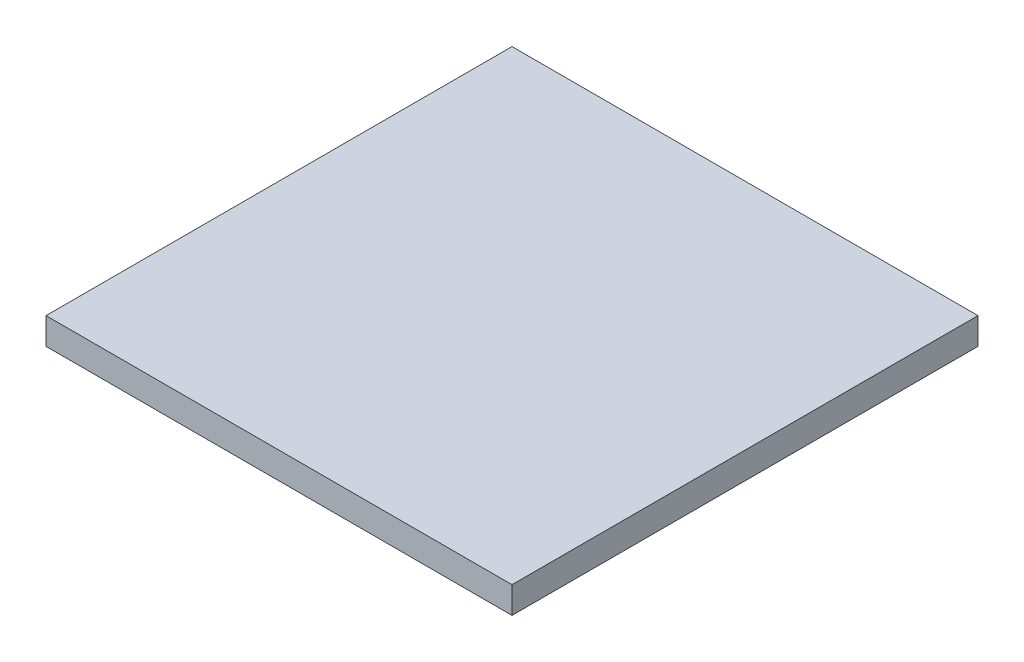
ISO-10303-21;
HEADER;
FILE_DESCRIPTION(('STEP AP214'),'2;1');
FILE_NAME('part.step','',(''),(''),'','','');
FILE_SCHEMA(('AUTOMOTIVE_DESIGN { 1 0 10303 214 1 1 1 1 }'));
ENDSEC;
DATA;
#1=APPLICATION_CONTEXT('core data for automotive mechanical design processes');
#2=APPLICATION_PROTOCOL_DEFINITION('international standard','automotive_design',2000,#1);
#3=PRODUCT_CONTEXT('',#1,'mechanical');
#4=PRODUCT('Part','Part','',(#3));
#5=PRODUCT_RELATED_PRODUCT_CATEGORY('part','',(#4));
#6=PRODUCT_DEFINITION_FORMATION('','',#4);
#7=PRODUCT_DEFINITION_CONTEXT('part definition',#1,'design');
#8=PRODUCT_DEFINITION('design','',#6,#7);
#9=PRODUCT_DEFINITION_SHAPE('','',#8);
#10=(LENGTH_UNIT() NAMED_UNIT(*) SI_UNIT(.MILLI.,.METRE.));
#11=(NAMED_UNIT(*) PLANE_ANGLE_UNIT() SI_UNIT($,.RADIAN.));
#12=(NAMED_UNIT(*) SI_UNIT($,.STERADIAN.) SOLID_ANGLE_UNIT());
#13=UNCERTAINTY_MEASURE_WITH_UNIT(LENGTH_MEASURE(1.E-05),#10,'distance_accuracy_value','');
#14=(GEOMETRIC_REPRESENTATION_CONTEXT(3) GLOBAL_UNCERTAINTY_ASSIGNED_CONTEXT((#13)) GLOBAL_UNIT_ASSIGNED_CONTEXT((#10,
#11,#12)) REPRESENTATION_CONTEXT('',''));
#15=CARTESIAN_POINT('',(0.,0.,0.));
#16=DIRECTION('',(0.,0.,1.));
#17=DIRECTION('',(1.,0.,0.));
#18=AXIS2_PLACEMENT_3D('',#15,#16,#17);
#19=CARTESIAN_POINT('',(-192.921686746988,20.,-110.165662650602));
#20=DIRECTION('',(1.,0.,0.));
#21=DIRECTION('',(0.,0.,-1.));
#22=AXIS2_PLACEMENT_3D('',#19,#20,#21);
#23=PLANE('',#22);
#24=DIRECTION('',(0.,0.,1.));
#25=VECTOR('',#24,1.);
#26=CARTESIAN_POINT('',(-192.921686746988,0.,-110.165662650602));
#27=LINE('',#26,#25);
#28=CARTESIAN_POINT('',(-192.921686746988,0.,-110.165662650602));
#29=VERTEX_POINT('',#28);
#30=CARTESIAN_POINT('',(-192.921686746988,0.,239.834337349398));
#31=VERTEX_POINT('',#30);
#32=EDGE_CURVE('E107',#29,#31,#27,.T.);
#33=ORIENTED_EDGE('',*,*,#32,.T.);
#34=DIRECTION('',(0.,-1.,0.));
#35=VECTOR('',#34,1.);
#36=CARTESIAN_POINT('',(-192.921686746988,20.,239.834337349398));
#37=LINE('',#36,#35);
#38=CARTESIAN_POINT('',(-192.921686746988,20.,239.834337349398));
#39=VERTEX_POINT('',#38);
#40=EDGE_CURVE('E11',#39,#31,#37,.T.);
#41=ORIENTED_EDGE('',*,*,#40,.F.);
#42=DIRECTION('',(0.,0.,1.));
#43=VECTOR('',#42,1.);
#44=CARTESIAN_POINT('',(-192.921686746988,20.,-110.165662650602));
#45=LINE('',#44,#43);
#46=CARTESIAN_POINT('',(-192.921686746988,20.,-110.165662650602));
#47=VERTEX_POINT('',#46);
#48=EDGE_CURVE('E91',#47,#39,#45,.T.);
#49=ORIENTED_EDGE('',*,*,#48,.F.);
#50=DIRECTION('',(0.,-1.,0.));
#51=VECTOR('',#50,1.);
#52=CARTESIAN_POINT('',(-192.921686746988,20.,-110.165662650602));
#53=LINE('',#52,#51);
#54=EDGE_CURVE('E103',#47,#29,#53,.T.);
#55=ORIENTED_EDGE('',*,*,#54,.T.);
#56=EDGE_LOOP('',(#33,#41,#49,#55));
#57=FACE_BOUND('',#56,.T.);
#58=ADVANCED_FACE('F39',(#57),#23,.F.);
#59=CARTESIAN_POINT('',(-192.921686746988,20.,239.834337349398));
#60=DIRECTION('',(0.,0.,-1.));
#61=DIRECTION('',(-1.,0.,0.));
#62=AXIS2_PLACEMENT_3D('',#59,#60,#61);
#63=PLANE('',#62);
#64=DIRECTION('',(1.,0.,0.));
#65=VECTOR('',#64,1.);
#66=CARTESIAN_POINT('',(-192.921686746988,0.,239.834337349398));
#67=LINE('',#66,#65);
#68=CARTESIAN_POINT('',(157.078313253012,0.,239.834337349398));
#69=VERTEX_POINT('',#68);
#70=EDGE_CURVE('E96',#31,#69,#67,.T.);
#71=ORIENTED_EDGE('',*,*,#70,.T.);
#72=DIRECTION('',(0.,-1.,0.));
#73=VECTOR('',#72,1.);
#74=CARTESIAN_POINT('',(157.078313253012,20.,239.834337349398));
#75=LINE('',#74,#73);
#76=CARTESIAN_POINT('',(157.078313253012,20.,239.834337349398));
#77=VERTEX_POINT('',#76);
#78=EDGE_CURVE('E48',#77,#69,#75,.T.);
#79=ORIENTED_EDGE('',*,*,#78,.F.);
#80=DIRECTION('',(1.,0.,0.));
#81=VECTOR('',#80,1.);
#82=CARTESIAN_POINT('',(-192.921686746988,20.,239.834337349398));
#83=LINE('',#82,#81);
#84=EDGE_CURVE('E86',#39,#77,#83,.T.);
#85=ORIENTED_EDGE('',*,*,#84,.F.);
#86=ORIENTED_EDGE('',*,*,#40,.T.);
#87=EDGE_LOOP('',(#71,#79,#85,#86));
#88=FACE_BOUND('',#87,.T.);
#89=ADVANCED_FACE('F95',(#88),#63,.F.);
#90=CARTESIAN_POINT('',(157.078313253012,20.,-110.165662650602));
#91=DIRECTION('',(-1.,0.,0.));
#92=DIRECTION('',(0.,0.,1.));
#93=AXIS2_PLACEMENT_3D('',#90,#91,#92);
#94=PLANE('',#93);
#95=DIRECTION('',(0.,0.,-1.));
#96=VECTOR('',#95,1.);
#97=CARTESIAN_POINT('',(157.078313253012,0.,-110.165662650602));
#98=LINE('',#97,#96);
#99=CARTESIAN_POINT('',(157.078313253012,0.,-110.165662650602));
#100=VERTEX_POINT('',#99);
#101=EDGE_CURVE('E73',#69,#100,#98,.T.);
#102=ORIENTED_EDGE('',*,*,#101,.T.);
#103=DIRECTION('',(0.,-1.,0.));
#104=VECTOR('',#103,1.);
#105=CARTESIAN_POINT('',(157.078313253012,20.,-110.165662650602));
#106=LINE('',#105,#104);
#107=CARTESIAN_POINT('',(157.078313253012,20.,-110.165662650602));
#108=VERTEX_POINT('',#107);
#109=EDGE_CURVE('E98',#108,#100,#106,.T.);
#110=ORIENTED_EDGE('',*,*,#109,.F.);
#111=DIRECTION('',(0.,0.,-1.));
#112=VECTOR('',#111,1.);
#113=CARTESIAN_POINT('',(157.078313253012,20.,-110.165662650602));
#114=LINE('',#113,#112);
#115=EDGE_CURVE('E89',#77,#108,#114,.T.);
#116=ORIENTED_EDGE('',*,*,#115,.F.);
#117=ORIENTED_EDGE('',*,*,#78,.T.);
#118=EDGE_LOOP('',(#102,#110,#116,#117));
#119=FACE_BOUND('',#118,.T.);
#120=ADVANCED_FACE('F99',(#119),#94,.F.);
#121=CARTESIAN_POINT('',(-192.921686746988,20.,-110.165662650602));
#122=DIRECTION('',(0.,0.,1.));
#123=DIRECTION('',(1.,0.,0.));
#124=AXIS2_PLACEMENT_3D('',#121,#122,#123);
#125=PLANE('',#124);
#126=DIRECTION('',(-1.,0.,0.));
#127=VECTOR('',#126,1.);
#128=CARTESIAN_POINT('',(-192.921686746988,0.,-110.165662650602));
#129=LINE('',#128,#127);
#130=EDGE_CURVE('E79',#100,#29,#129,.T.);
#131=ORIENTED_EDGE('',*,*,#130,.T.);
#132=ORIENTED_EDGE('',*,*,#54,.F.);
#133=DIRECTION('',(-1.,0.,0.));
#134=VECTOR('',#133,1.);
#135=CARTESIAN_POINT('',(-192.921686746988,20.,-110.165662650602));
#136=LINE('',#135,#134);
#137=EDGE_CURVE('E56',#108,#47,#136,.T.);
#138=ORIENTED_EDGE('',*,*,#137,.F.);
#139=ORIENTED_EDGE('',*,*,#109,.T.);
#140=EDGE_LOOP('',(#131,#132,#138,#139));
#141=FACE_BOUND('',#140,.T.);
#142=ADVANCED_FACE('F120',(#141),#125,.F.);
#143=CARTESIAN_POINT('',(0.,20.,0.));
#144=DIRECTION('',(0.,1.,0.));
#145=DIRECTION('',(0.,0.,1.));
#146=AXIS2_PLACEMENT_3D('',#143,#144,#145);
#147=PLANE('',#146);
#148=ORIENTED_EDGE('',*,*,#48,.T.);
#149=ORIENTED_EDGE('',*,*,#84,.T.);
#150=ORIENTED_EDGE('',*,*,#115,.T.);
#151=ORIENTED_EDGE('',*,*,#137,.T.);
#152=EDGE_LOOP('',(#148,#149,#150,#151));
#153=FACE_BOUND('',#152,.T.);
#154=ADVANCED_FACE('F87',(#153),#147,.T.);
#155=CARTESIAN_POINT('',(0.,0.,0.));
#156=DIRECTION('',(0.,1.,0.));
#157=DIRECTION('',(0.,0.,1.));
#158=AXIS2_PLACEMENT_3D('',#155,#156,#157);
#159=PLANE('',#158);
#160=ORIENTED_EDGE('',*,*,#32,.F.);
#161=ORIENTED_EDGE('',*,*,#130,.F.);
#162=ORIENTED_EDGE('',*,*,#101,.F.);
#163=ORIENTED_EDGE('',*,*,#70,.F.);
#164=EDGE_LOOP('',(#160,#161,#162,#163));
#165=FACE_BOUND('',#164,.T.);
#166=ADVANCED_FACE('F123',(#165),#159,.F.);
#167=CLOSED_SHELL('',(#58,#89,#120,#142,#154,#166));
#168=MANIFOLD_SOLID_BREP('B2',#167);
#169=ADVANCED_BREP_SHAPE_REPRESENTATION('',(#18,#168),#14);
#170=SHAPE_DEFINITION_REPRESENTATION(#9,#169);
ENDSEC;
END-ISO-10303-21;
